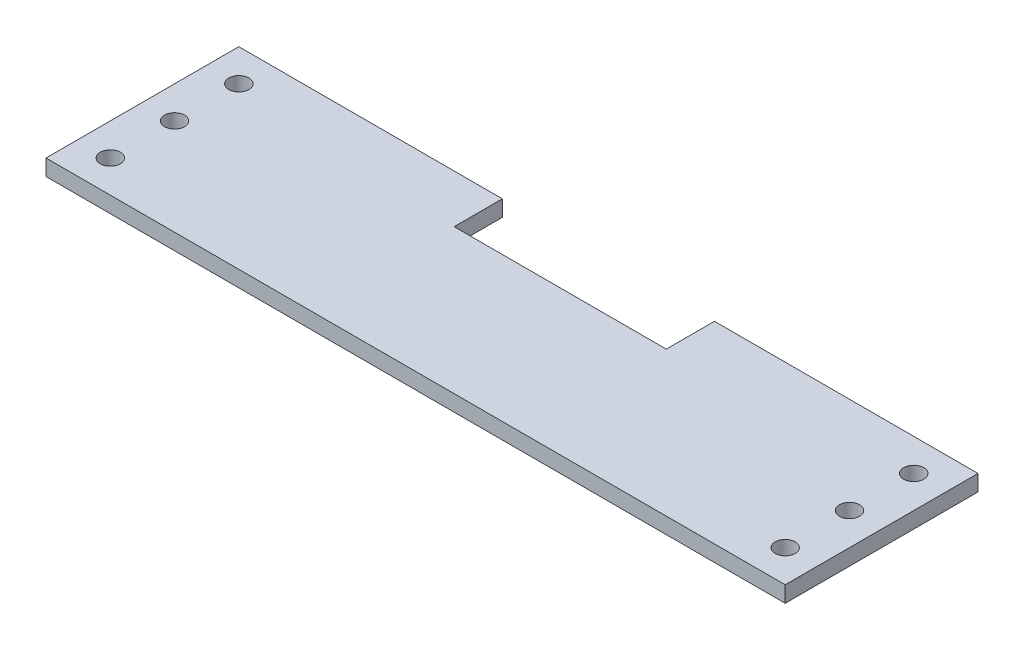
ISO-10303-21;
HEADER;
FILE_DESCRIPTION(('STEP AP214'),'2;1');
FILE_NAME('part.step','',(''),(''),'','','');
FILE_SCHEMA(('AUTOMOTIVE_DESIGN { 1 0 10303 214 1 1 1 1 }'));
ENDSEC;
DATA;
#1=APPLICATION_CONTEXT('core data for automotive mechanical design processes');
#2=APPLICATION_PROTOCOL_DEFINITION('international standard','automotive_design',2000,#1);
#3=PRODUCT_CONTEXT('',#1,'mechanical');
#4=PRODUCT('Part','Part','',(#3));
#5=PRODUCT_RELATED_PRODUCT_CATEGORY('part','',(#4));
#6=PRODUCT_DEFINITION_FORMATION('','',#4);
#7=PRODUCT_DEFINITION_CONTEXT('part definition',#1,'design');
#8=PRODUCT_DEFINITION('design','',#6,#7);
#9=PRODUCT_DEFINITION_SHAPE('','',#8);
#10=(LENGTH_UNIT() NAMED_UNIT(*) SI_UNIT(.MILLI.,.METRE.));
#11=(NAMED_UNIT(*) PLANE_ANGLE_UNIT() SI_UNIT($,.RADIAN.));
#12=(NAMED_UNIT(*) SI_UNIT($,.STERADIAN.) SOLID_ANGLE_UNIT());
#13=UNCERTAINTY_MEASURE_WITH_UNIT(LENGTH_MEASURE(1.E-05),#10,'distance_accuracy_value','');
#14=(GEOMETRIC_REPRESENTATION_CONTEXT(3) GLOBAL_UNCERTAINTY_ASSIGNED_CONTEXT((#13)) GLOBAL_UNIT_ASSIGNED_CONTEXT((#10,
#11,#12)) REPRESENTATION_CONTEXT('',''));
#15=CARTESIAN_POINT('',(0.,0.,0.));
#16=DIRECTION('',(0.,0.,1.));
#17=DIRECTION('',(1.,0.,0.));
#18=AXIS2_PLACEMENT_3D('',#15,#16,#17);
#19=CARTESIAN_POINT('',(0.,6.35,-76.2));
#20=DIRECTION('',(0.,0.,1.));
#21=DIRECTION('',(1.,0.,0.));
#22=AXIS2_PLACEMENT_3D('',#19,#20,#21);
#23=PLANE('',#22);
#24=DIRECTION('',(-1.,0.,0.));
#25=VECTOR('',#24,1.);
#26=CARTESIAN_POINT('',(0.,6.35,-76.2));
#27=LINE('',#26,#25);
#28=CARTESIAN_POINT('',(104.14,6.35,-76.2));
#29=VERTEX_POINT('',#28);
#30=CARTESIAN_POINT('',(0.,6.35,-76.2));
#31=VERTEX_POINT('',#30);
#32=EDGE_CURVE('E57',#29,#31,#27,.T.);
#33=ORIENTED_EDGE('',*,*,#32,.F.);
#34=DIRECTION('',(0.,1.,0.));
#35=VECTOR('',#34,1.);
#36=CARTESIAN_POINT('',(104.14,-0.00100000000000013,-76.2));
#37=LINE('',#36,#35);
#38=CARTESIAN_POINT('',(104.14,0.,-76.2));
#39=VERTEX_POINT('',#38);
#40=EDGE_CURVE('E114',#39,#29,#37,.T.);
#41=ORIENTED_EDGE('',*,*,#40,.F.);
#42=DIRECTION('',(-1.,0.,0.));
#43=VECTOR('',#42,1.);
#44=CARTESIAN_POINT('',(0.,0.,-76.2));
#45=LINE('',#44,#43);
#46=CARTESIAN_POINT('',(0.,0.,-76.2));
#47=VERTEX_POINT('',#46);
#48=EDGE_CURVE('E79',#39,#47,#45,.T.);
#49=ORIENTED_EDGE('',*,*,#48,.T.);
#50=DIRECTION('',(0.,-1.,0.));
#51=VECTOR('',#50,1.);
#52=CARTESIAN_POINT('',(0.,6.35,-76.2));
#53=LINE('',#52,#51);
#54=EDGE_CURVE('E139',#31,#47,#53,.T.);
#55=ORIENTED_EDGE('',*,*,#54,.F.);
#56=EDGE_LOOP('',(#33,#41,#49,#55));
#57=FACE_BOUND('',#56,.T.);
#58=ADVANCED_FACE('F33',(#57),#23,.F.);
#59=CARTESIAN_POINT('',(0.,6.35,0.));
#60=DIRECTION('',(0.,-1.,0.));
#61=DIRECTION('',(0.,0.,-1.));
#62=AXIS2_PLACEMENT_3D('',#59,#60,#61);
#63=PLANE('',#62);
#64=DIRECTION('',(1.,0.,0.));
#65=VECTOR('',#64,1.);
#66=CARTESIAN_POINT('',(104.14,6.35,-57.15));
#67=LINE('',#66,#65);
#68=CARTESIAN_POINT('',(104.14,6.35,-57.15));
#69=VERTEX_POINT('',#68);
#70=CARTESIAN_POINT('',(187.96,6.35,-57.15));
#71=VERTEX_POINT('',#70);
#72=EDGE_CURVE('E198',#69,#71,#67,.T.);
#73=ORIENTED_EDGE('',*,*,#72,.F.);
#74=DIRECTION('',(0.,0.,1.));
#75=VECTOR('',#74,1.);
#76=CARTESIAN_POINT('',(104.14,6.35,-76.2));
#77=LINE('',#76,#75);
#78=EDGE_CURVE('E201',#29,#69,#77,.T.);
#79=ORIENTED_EDGE('',*,*,#78,.F.);
#80=ORIENTED_EDGE('',*,*,#32,.T.);
#81=DIRECTION('',(0.,0.,1.));
#82=VECTOR('',#81,1.);
#83=CARTESIAN_POINT('',(0.,6.35,0.));
#84=LINE('',#83,#82);
#85=CARTESIAN_POINT('',(0.,6.35,0.));
#86=VERTEX_POINT('',#85);
#87=EDGE_CURVE('E132',#31,#86,#84,.T.);
#88=ORIENTED_EDGE('',*,*,#87,.T.);
#89=DIRECTION('',(1.,0.,0.));
#90=VECTOR('',#89,1.);
#91=CARTESIAN_POINT('',(0.,6.35,0.));
#92=LINE('',#91,#90);
#93=CARTESIAN_POINT('',(292.1,6.35,0.));
#94=VERTEX_POINT('',#93);
#95=EDGE_CURVE('E86',#86,#94,#92,.T.);
#96=ORIENTED_EDGE('',*,*,#95,.T.);
#97=DIRECTION('',(0.,0.,-1.));
#98=VECTOR('',#97,1.);
#99=CARTESIAN_POINT('',(292.1,6.35,0.));
#100=LINE('',#99,#98);
#101=CARTESIAN_POINT('',(292.1,6.35,-76.2));
#102=VERTEX_POINT('',#101);
#103=EDGE_CURVE('E146',#94,#102,#100,.T.);
#104=ORIENTED_EDGE('',*,*,#103,.T.);
#105=CARTESIAN_POINT('',(187.96,6.35,-76.2));
#106=VERTEX_POINT('',#105);
#107=EDGE_CURVE('E141',#102,#106,#27,.T.);
#108=ORIENTED_EDGE('',*,*,#107,.T.);
#109=DIRECTION('',(0.,0.,-1.));
#110=VECTOR('',#109,1.);
#111=CARTESIAN_POINT('',(187.96,6.35,-76.2));
#112=LINE('',#111,#110);
#113=EDGE_CURVE('E48',#71,#106,#112,.T.);
#114=ORIENTED_EDGE('',*,*,#113,.F.);
#115=EDGE_LOOP('',(#73,#79,#80,#88,#96,#104,#108,#114));
#116=FACE_BOUND('',#115,.T.);
#117=CARTESIAN_POINT('',(12.7,6.35,-63.5));
#118=DIRECTION('',(0.,1.,0.));
#119=DIRECTION('',(0.,0.,1.));
#120=AXIS2_PLACEMENT_3D('',#117,#118,#119);
#121=CIRCLE('',#120,3.96875);
#122=CARTESIAN_POINT('',(12.7,6.35,-59.53125));
#123=VERTEX_POINT('',#122);
#124=EDGE_CURVE('E151',#123,#123,#121,.T.);
#125=ORIENTED_EDGE('',*,*,#124,.F.);
#126=EDGE_LOOP('',(#125));
#127=FACE_BOUND('',#126,.T.);
#128=CARTESIAN_POINT('',(12.7,6.35,-38.1));
#129=DIRECTION('',(0.,1.,0.));
#130=DIRECTION('',(0.,0.,1.));
#131=AXIS2_PLACEMENT_3D('',#128,#129,#130);
#132=CIRCLE('',#131,3.96875);
#133=CARTESIAN_POINT('',(12.7,6.35,-34.13125));
#134=VERTEX_POINT('',#133);
#135=EDGE_CURVE('E160',#134,#134,#132,.T.);
#136=ORIENTED_EDGE('',*,*,#135,.F.);
#137=EDGE_LOOP('',(#136));
#138=FACE_BOUND('',#137,.T.);
#139=CARTESIAN_POINT('',(12.7,6.35,-12.7));
#140=DIRECTION('',(0.,1.,0.));
#141=DIRECTION('',(0.,0.,1.));
#142=AXIS2_PLACEMENT_3D('',#139,#140,#141);
#143=CIRCLE('',#142,3.96875);
#144=CARTESIAN_POINT('',(12.7,6.35,-8.73125));
#145=VERTEX_POINT('',#144);
#146=EDGE_CURVE('E166',#145,#145,#143,.T.);
#147=ORIENTED_EDGE('',*,*,#146,.F.);
#148=EDGE_LOOP('',(#147));
#149=FACE_BOUND('',#148,.T.);
#150=CARTESIAN_POINT('',(279.4,6.35,-12.7));
#151=DIRECTION('',(0.,1.,0.));
#152=DIRECTION('',(0.,0.,-1.));
#153=AXIS2_PLACEMENT_3D('',#150,#151,#152);
#154=CIRCLE('',#153,3.96875000000005);
#155=CARTESIAN_POINT('',(279.4,6.35,-16.6687500000001));
#156=VERTEX_POINT('',#155);
#157=EDGE_CURVE('E172',#156,#156,#154,.T.);
#158=ORIENTED_EDGE('',*,*,#157,.F.);
#159=EDGE_LOOP('',(#158));
#160=FACE_BOUND('',#159,.T.);
#161=CARTESIAN_POINT('',(279.4,6.35,-38.1));
#162=DIRECTION('',(0.,1.,0.));
#163=DIRECTION('',(0.,0.,-1.));
#164=AXIS2_PLACEMENT_3D('',#161,#162,#163);
#165=CIRCLE('',#164,3.96874999999999);
#166=CARTESIAN_POINT('',(279.4,6.35,-42.06875));
#167=VERTEX_POINT('',#166);
#168=EDGE_CURVE('E178',#167,#167,#165,.T.);
#169=ORIENTED_EDGE('',*,*,#168,.F.);
#170=EDGE_LOOP('',(#169));
#171=FACE_BOUND('',#170,.T.);
#172=CARTESIAN_POINT('',(279.4,6.35,-63.5));
#173=DIRECTION('',(0.,1.,0.));
#174=DIRECTION('',(0.,0.,-1.));
#175=AXIS2_PLACEMENT_3D('',#172,#173,#174);
#176=CIRCLE('',#175,3.96874999999993);
#177=CARTESIAN_POINT('',(279.4,6.35,-67.46875));
#178=VERTEX_POINT('',#177);
#179=EDGE_CURVE('E184',#178,#178,#176,.T.);
#180=ORIENTED_EDGE('',*,*,#179,.F.);
#181=EDGE_LOOP('',(#180));
#182=FACE_BOUND('',#181,.T.);
#183=ADVANCED_FACE('F211',(#116,#127,#138,#149,#160,#171,#182),#63,.F.);
#184=CARTESIAN_POINT('',(0.,0.,0.));
#185=DIRECTION('',(0.,-1.,0.));
#186=DIRECTION('',(0.,0.,-1.));
#187=AXIS2_PLACEMENT_3D('',#184,#185,#186);
#188=PLANE('',#187);
#189=DIRECTION('',(0.,0.,1.));
#190=VECTOR('',#189,1.);
#191=CARTESIAN_POINT('',(104.14,0.,-76.2));
#192=LINE('',#191,#190);
#193=CARTESIAN_POINT('',(104.14,0.,-57.15));
#194=VERTEX_POINT('',#193);
#195=EDGE_CURVE('E126',#39,#194,#192,.T.);
#196=ORIENTED_EDGE('',*,*,#195,.T.);
#197=DIRECTION('',(1.,0.,0.));
#198=VECTOR('',#197,1.);
#199=CARTESIAN_POINT('',(104.14,0.,-57.15));
#200=LINE('',#199,#198);
#201=CARTESIAN_POINT('',(187.96,0.,-57.15));
#202=VERTEX_POINT('',#201);
#203=EDGE_CURVE('E125',#194,#202,#200,.T.);
#204=ORIENTED_EDGE('',*,*,#203,.T.);
#205=DIRECTION('',(0.,0.,-1.));
#206=VECTOR('',#205,1.);
#207=CARTESIAN_POINT('',(187.96,0.,-76.2));
#208=LINE('',#207,#206);
#209=CARTESIAN_POINT('',(187.96,0.,-76.2));
#210=VERTEX_POINT('',#209);
#211=EDGE_CURVE('E108',#202,#210,#208,.T.);
#212=ORIENTED_EDGE('',*,*,#211,.T.);
#213=CARTESIAN_POINT('',(292.1,0.,-76.2));
#214=VERTEX_POINT('',#213);
#215=EDGE_CURVE('E124',#214,#210,#45,.T.);
#216=ORIENTED_EDGE('',*,*,#215,.F.);
#217=DIRECTION('',(0.,0.,-1.));
#218=VECTOR('',#217,1.);
#219=CARTESIAN_POINT('',(292.1,0.,0.));
#220=LINE('',#219,#218);
#221=CARTESIAN_POINT('',(292.1,0.,0.));
#222=VERTEX_POINT('',#221);
#223=EDGE_CURVE('E135',#222,#214,#220,.T.);
#224=ORIENTED_EDGE('',*,*,#223,.F.);
#225=DIRECTION('',(1.,0.,0.));
#226=VECTOR('',#225,1.);
#227=CARTESIAN_POINT('',(0.,0.,0.));
#228=LINE('',#227,#226);
#229=CARTESIAN_POINT('',(0.,0.,0.));
#230=VERTEX_POINT('',#229);
#231=EDGE_CURVE('E148',#230,#222,#228,.T.);
#232=ORIENTED_EDGE('',*,*,#231,.F.);
#233=DIRECTION('',(0.,0.,1.));
#234=VECTOR('',#233,1.);
#235=CARTESIAN_POINT('',(0.,0.,0.));
#236=LINE('',#235,#234);
#237=EDGE_CURVE('E149',#47,#230,#236,.T.);
#238=ORIENTED_EDGE('',*,*,#237,.F.);
#239=ORIENTED_EDGE('',*,*,#48,.F.);
#240=EDGE_LOOP('',(#196,#204,#212,#216,#224,#232,#238,#239));
#241=FACE_BOUND('',#240,.T.);
#242=CARTESIAN_POINT('',(279.4,0.,-38.1));
#243=DIRECTION('',(0.,1.,0.));
#244=DIRECTION('',(0.,0.,-1.));
#245=AXIS2_PLACEMENT_3D('',#242,#243,#244);
#246=CIRCLE('',#245,3.96874999999999);
#247=CARTESIAN_POINT('',(279.4,0.,-42.06875));
#248=VERTEX_POINT('',#247);
#249=EDGE_CURVE('E181',#248,#248,#246,.T.);
#250=ORIENTED_EDGE('',*,*,#249,.T.);
#251=EDGE_LOOP('',(#250));
#252=FACE_BOUND('',#251,.T.);
#253=CARTESIAN_POINT('',(12.7,0.,-12.7));
#254=DIRECTION('',(0.,1.,0.));
#255=DIRECTION('',(0.,0.,1.));
#256=AXIS2_PLACEMENT_3D('',#253,#254,#255);
#257=CIRCLE('',#256,3.96875);
#258=CARTESIAN_POINT('',(12.7,0.,-8.73125));
#259=VERTEX_POINT('',#258);
#260=EDGE_CURVE('E169',#259,#259,#257,.T.);
#261=ORIENTED_EDGE('',*,*,#260,.T.);
#262=EDGE_LOOP('',(#261));
#263=FACE_BOUND('',#262,.T.);
#264=CARTESIAN_POINT('',(12.7,0.,-63.5));
#265=DIRECTION('',(0.,1.,0.));
#266=DIRECTION('',(0.,0.,1.));
#267=AXIS2_PLACEMENT_3D('',#264,#265,#266);
#268=CIRCLE('',#267,3.96875);
#269=CARTESIAN_POINT('',(12.7,0.,-59.53125));
#270=VERTEX_POINT('',#269);
#271=EDGE_CURVE('E157',#270,#270,#268,.T.);
#272=ORIENTED_EDGE('',*,*,#271,.T.);
#273=EDGE_LOOP('',(#272));
#274=FACE_BOUND('',#273,.T.);
#275=CARTESIAN_POINT('',(12.7,0.,-38.1));
#276=DIRECTION('',(0.,1.,0.));
#277=DIRECTION('',(0.,0.,1.));
#278=AXIS2_PLACEMENT_3D('',#275,#276,#277);
#279=CIRCLE('',#278,3.96875);
#280=CARTESIAN_POINT('',(12.7,0.,-34.13125));
#281=VERTEX_POINT('',#280);
#282=EDGE_CURVE('E163',#281,#281,#279,.T.);
#283=ORIENTED_EDGE('',*,*,#282,.T.);
#284=EDGE_LOOP('',(#283));
#285=FACE_BOUND('',#284,.T.);
#286=CARTESIAN_POINT('',(279.4,0.,-12.7));
#287=DIRECTION('',(0.,1.,0.));
#288=DIRECTION('',(0.,0.,-1.));
#289=AXIS2_PLACEMENT_3D('',#286,#287,#288);
#290=CIRCLE('',#289,3.96875000000005);
#291=CARTESIAN_POINT('',(279.4,0.,-16.6687500000001));
#292=VERTEX_POINT('',#291);
#293=EDGE_CURVE('E175',#292,#292,#290,.T.);
#294=ORIENTED_EDGE('',*,*,#293,.T.);
#295=EDGE_LOOP('',(#294));
#296=FACE_BOUND('',#295,.T.);
#297=CARTESIAN_POINT('',(279.4,0.,-63.5));
#298=DIRECTION('',(0.,1.,0.));
#299=DIRECTION('',(0.,0.,-1.));
#300=AXIS2_PLACEMENT_3D('',#297,#298,#299);
#301=CIRCLE('',#300,3.96874999999993);
#302=CARTESIAN_POINT('',(279.4,0.,-67.46875));
#303=VERTEX_POINT('',#302);
#304=EDGE_CURVE('E187',#303,#303,#301,.T.);
#305=ORIENTED_EDGE('',*,*,#304,.T.);
#306=EDGE_LOOP('',(#305));
#307=FACE_BOUND('',#306,.T.);
#308=ADVANCED_FACE('F121',(#241,#252,#263,#274,#285,#296,#307),#188,.T.);
#309=CARTESIAN_POINT('',(0.,6.35,0.));
#310=DIRECTION('',(1.,0.,0.));
#311=DIRECTION('',(0.,0.,-1.));
#312=AXIS2_PLACEMENT_3D('',#309,#310,#311);
#313=PLANE('',#312);
#314=ORIENTED_EDGE('',*,*,#237,.T.);
#315=DIRECTION('',(0.,-1.,0.));
#316=VECTOR('',#315,1.);
#317=CARTESIAN_POINT('',(0.,6.35,0.));
#318=LINE('',#317,#316);
#319=EDGE_CURVE('E11',#86,#230,#318,.T.);
#320=ORIENTED_EDGE('',*,*,#319,.F.);
#321=ORIENTED_EDGE('',*,*,#87,.F.);
#322=ORIENTED_EDGE('',*,*,#54,.T.);
#323=EDGE_LOOP('',(#314,#320,#321,#322));
#324=FACE_BOUND('',#323,.T.);
#325=ADVANCED_FACE('F35',(#324),#313,.F.);
#326=CARTESIAN_POINT('',(0.,6.35,0.));
#327=DIRECTION('',(0.,0.,-1.));
#328=DIRECTION('',(-1.,0.,0.));
#329=AXIS2_PLACEMENT_3D('',#326,#327,#328);
#330=PLANE('',#329);
#331=ORIENTED_EDGE('',*,*,#231,.T.);
#332=DIRECTION('',(0.,-1.,0.));
#333=VECTOR('',#332,1.);
#334=CARTESIAN_POINT('',(292.1,6.35,0.));
#335=LINE('',#334,#333);
#336=EDGE_CURVE('E41',#94,#222,#335,.T.);
#337=ORIENTED_EDGE('',*,*,#336,.F.);
#338=ORIENTED_EDGE('',*,*,#95,.F.);
#339=ORIENTED_EDGE('',*,*,#319,.T.);
#340=EDGE_LOOP('',(#331,#337,#338,#339));
#341=FACE_BOUND('',#340,.T.);
#342=ADVANCED_FACE('F239',(#341),#330,.F.);
#343=CARTESIAN_POINT('',(292.1,6.35,0.));
#344=DIRECTION('',(-1.,0.,0.));
#345=DIRECTION('',(0.,0.,1.));
#346=AXIS2_PLACEMENT_3D('',#343,#344,#345);
#347=PLANE('',#346);
#348=ORIENTED_EDGE('',*,*,#223,.T.);
#349=DIRECTION('',(0.,-1.,0.));
#350=VECTOR('',#349,1.);
#351=CARTESIAN_POINT('',(292.1,6.35,-76.2));
#352=LINE('',#351,#350);
#353=EDGE_CURVE('E131',#102,#214,#352,.T.);
#354=ORIENTED_EDGE('',*,*,#353,.F.);
#355=ORIENTED_EDGE('',*,*,#103,.F.);
#356=ORIENTED_EDGE('',*,*,#336,.T.);
#357=EDGE_LOOP('',(#348,#354,#355,#356));
#358=FACE_BOUND('',#357,.T.);
#359=ADVANCED_FACE('F145',(#358),#347,.F.);
#360=ORIENTED_EDGE('',*,*,#215,.T.);
#361=DIRECTION('',(0.,1.,0.));
#362=VECTOR('',#361,1.);
#363=CARTESIAN_POINT('',(187.96,-0.00100000000000013,-76.2));
#364=LINE('',#363,#362);
#365=EDGE_CURVE('E105',#210,#106,#364,.T.);
#366=ORIENTED_EDGE('',*,*,#365,.T.);
#367=ORIENTED_EDGE('',*,*,#107,.F.);
#368=ORIENTED_EDGE('',*,*,#353,.T.);
#369=EDGE_LOOP('',(#360,#366,#367,#368));
#370=FACE_BOUND('',#369,.T.);
#371=ADVANCED_FACE('F129',(#370),#23,.F.);
#372=CARTESIAN_POINT('',(12.7,6.35,-63.5));
#373=DIRECTION('',(0.,-1.,0.));
#374=DIRECTION('',(0.,0.,-1.));
#375=AXIS2_PLACEMENT_3D('',#372,#373,#374);
#376=CYLINDRICAL_SURFACE('',#375,3.96875);
#377=ORIENTED_EDGE('',*,*,#124,.T.);
#378=EDGE_LOOP('',(#377));
#379=FACE_BOUND('',#378,.T.);
#380=ORIENTED_EDGE('',*,*,#271,.F.);
#381=EDGE_LOOP('',(#380));
#382=FACE_BOUND('',#381,.T.);
#383=ADVANCED_FACE('F231',(#379,#382),#376,.F.);
#384=CARTESIAN_POINT('',(12.7,6.35,-38.1));
#385=DIRECTION('',(0.,-1.,0.));
#386=DIRECTION('',(0.,0.,-1.));
#387=AXIS2_PLACEMENT_3D('',#384,#385,#386);
#388=CYLINDRICAL_SURFACE('',#387,3.96875);
#389=ORIENTED_EDGE('',*,*,#135,.T.);
#390=EDGE_LOOP('',(#389));
#391=FACE_BOUND('',#390,.T.);
#392=ORIENTED_EDGE('',*,*,#282,.F.);
#393=EDGE_LOOP('',(#392));
#394=FACE_BOUND('',#393,.T.);
#395=ADVANCED_FACE('F236',(#391,#394),#388,.F.);
#396=CARTESIAN_POINT('',(12.7,6.35,-12.7));
#397=DIRECTION('',(0.,-1.,0.));
#398=DIRECTION('',(0.,0.,-1.));
#399=AXIS2_PLACEMENT_3D('',#396,#397,#398);
#400=CYLINDRICAL_SURFACE('',#399,3.96875);
#401=ORIENTED_EDGE('',*,*,#146,.T.);
#402=EDGE_LOOP('',(#401));
#403=FACE_BOUND('',#402,.T.);
#404=ORIENTED_EDGE('',*,*,#260,.F.);
#405=EDGE_LOOP('',(#404));
#406=FACE_BOUND('',#405,.T.);
#407=ADVANCED_FACE('F254',(#403,#406),#400,.F.);
#408=CARTESIAN_POINT('',(279.4,6.35,-12.7));
#409=DIRECTION('',(0.,-1.,0.));
#410=DIRECTION('',(0.,0.,-1.));
#411=AXIS2_PLACEMENT_3D('',#408,#409,#410);
#412=CYLINDRICAL_SURFACE('',#411,3.96875000000005);
#413=ORIENTED_EDGE('',*,*,#157,.T.);
#414=EDGE_LOOP('',(#413));
#415=FACE_BOUND('',#414,.T.);
#416=ORIENTED_EDGE('',*,*,#293,.F.);
#417=EDGE_LOOP('',(#416));
#418=FACE_BOUND('',#417,.T.);
#419=ADVANCED_FACE('F258',(#415,#418),#412,.F.);
#420=CARTESIAN_POINT('',(279.4,6.35,-38.1));
#421=DIRECTION('',(0.,-1.,0.));
#422=DIRECTION('',(0.,0.,-1.));
#423=AXIS2_PLACEMENT_3D('',#420,#421,#422);
#424=CYLINDRICAL_SURFACE('',#423,3.96874999999999);
#425=ORIENTED_EDGE('',*,*,#168,.T.);
#426=EDGE_LOOP('',(#425));
#427=FACE_BOUND('',#426,.T.);
#428=ORIENTED_EDGE('',*,*,#249,.F.);
#429=EDGE_LOOP('',(#428));
#430=FACE_BOUND('',#429,.T.);
#431=ADVANCED_FACE('F262',(#427,#430),#424,.F.);
#432=CARTESIAN_POINT('',(279.4,6.35,-63.5));
#433=DIRECTION('',(0.,-1.,0.));
#434=DIRECTION('',(0.,0.,-1.));
#435=AXIS2_PLACEMENT_3D('',#432,#433,#434);
#436=CYLINDRICAL_SURFACE('',#435,3.96874999999993);
#437=ORIENTED_EDGE('',*,*,#179,.T.);
#438=EDGE_LOOP('',(#437));
#439=FACE_BOUND('',#438,.T.);
#440=ORIENTED_EDGE('',*,*,#304,.F.);
#441=EDGE_LOOP('',(#440));
#442=FACE_BOUND('',#441,.T.);
#443=ADVANCED_FACE('F266',(#439,#442),#436,.F.);
#444=CARTESIAN_POINT('',(104.14,-0.00100000000000013,-76.2));
#445=DIRECTION('',(-1.,0.,0.));
#446=DIRECTION('',(0.,0.,1.));
#447=AXIS2_PLACEMENT_3D('',#444,#445,#446);
#448=PLANE('',#447);
#449=ORIENTED_EDGE('',*,*,#40,.T.);
#450=ORIENTED_EDGE('',*,*,#78,.T.);
#451=DIRECTION('',(0.,1.,0.));
#452=VECTOR('',#451,1.);
#453=CARTESIAN_POINT('',(104.14,-0.00100000000000013,-57.15));
#454=LINE('',#453,#452);
#455=EDGE_CURVE('E193',#194,#69,#454,.T.);
#456=ORIENTED_EDGE('',*,*,#455,.F.);
#457=ORIENTED_EDGE('',*,*,#195,.F.);
#458=EDGE_LOOP('',(#449,#450,#456,#457));
#459=FACE_BOUND('',#458,.T.);
#460=ADVANCED_FACE('F206',(#459),#448,.F.);
#461=CARTESIAN_POINT('',(187.96,-0.00100000000000013,-76.2));
#462=DIRECTION('',(1.,0.,0.));
#463=DIRECTION('',(0.,0.,-1.));
#464=AXIS2_PLACEMENT_3D('',#461,#462,#463);
#465=PLANE('',#464);
#466=DIRECTION('',(0.,1.,0.));
#467=VECTOR('',#466,1.);
#468=CARTESIAN_POINT('',(187.96,-0.00100000000000013,-57.15));
#469=LINE('',#468,#467);
#470=EDGE_CURVE('E115',#202,#71,#469,.T.);
#471=ORIENTED_EDGE('',*,*,#470,.T.);
#472=ORIENTED_EDGE('',*,*,#113,.T.);
#473=ORIENTED_EDGE('',*,*,#365,.F.);
#474=ORIENTED_EDGE('',*,*,#211,.F.);
#475=EDGE_LOOP('',(#471,#472,#473,#474));
#476=FACE_BOUND('',#475,.T.);
#477=ADVANCED_FACE('F107',(#476),#465,.F.);
#478=CARTESIAN_POINT('',(104.14,-0.00100000000000013,-57.15));
#479=DIRECTION('',(0.,0.,1.));
#480=DIRECTION('',(1.,0.,0.));
#481=AXIS2_PLACEMENT_3D('',#478,#479,#480);
#482=PLANE('',#481);
#483=ORIENTED_EDGE('',*,*,#455,.T.);
#484=ORIENTED_EDGE('',*,*,#72,.T.);
#485=ORIENTED_EDGE('',*,*,#470,.F.);
#486=ORIENTED_EDGE('',*,*,#203,.F.);
#487=EDGE_LOOP('',(#483,#484,#485,#486));
#488=FACE_BOUND('',#487,.T.);
#489=ADVANCED_FACE('F214',(#488),#482,.F.);
#490=CLOSED_SHELL('',(#58,#183,#308,#325,#342,#359,#371,#383,#395,#407,#419,#431,#443,#460,#477,#489));
#491=MANIFOLD_SOLID_BREP('B2',#490);
#492=ADVANCED_BREP_SHAPE_REPRESENTATION('',(#18,#491),#14);
#493=SHAPE_DEFINITION_REPRESENTATION(#9,#492);
ENDSEC;
END-ISO-10303-21;
